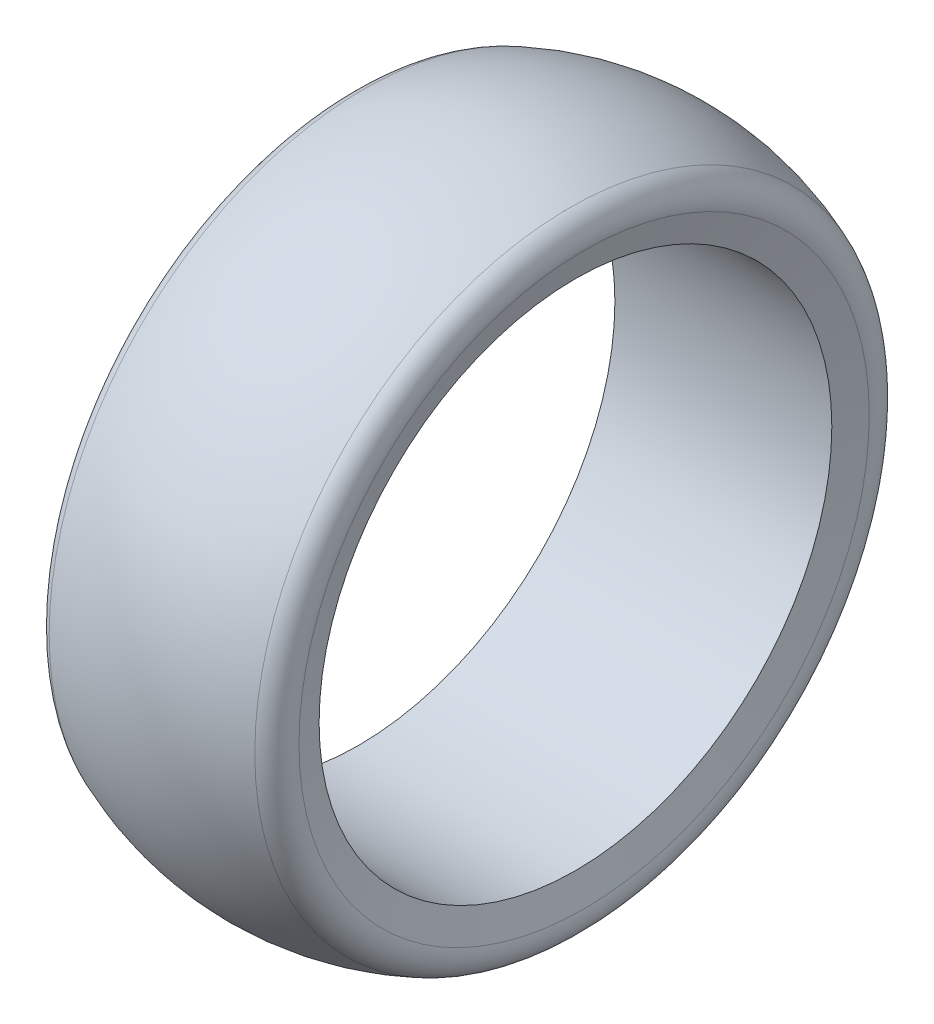
ISO-10303-21;
HEADER;
FILE_DESCRIPTION(('STEP AP214'),'2;1');
FILE_NAME('part.step','',(''),(''),'','','');
FILE_SCHEMA(('AUTOMOTIVE_DESIGN { 1 0 10303 214 1 1 1 1 }'));
ENDSEC;
DATA;
#1=APPLICATION_CONTEXT('core data for automotive mechanical design processes');
#2=APPLICATION_PROTOCOL_DEFINITION('international standard','automotive_design',2000,#1);
#3=PRODUCT_CONTEXT('',#1,'mechanical');
#4=PRODUCT('Part','Part','',(#3));
#5=PRODUCT_RELATED_PRODUCT_CATEGORY('part','',(#4));
#6=PRODUCT_DEFINITION_FORMATION('','',#4);
#7=PRODUCT_DEFINITION_CONTEXT('part definition',#1,'design');
#8=PRODUCT_DEFINITION('design','',#6,#7);
#9=PRODUCT_DEFINITION_SHAPE('','',#8);
#10=(LENGTH_UNIT() NAMED_UNIT(*) SI_UNIT(.MILLI.,.METRE.));
#11=(NAMED_UNIT(*) PLANE_ANGLE_UNIT() SI_UNIT($,.RADIAN.));
#12=(NAMED_UNIT(*) SI_UNIT($,.STERADIAN.) SOLID_ANGLE_UNIT());
#13=UNCERTAINTY_MEASURE_WITH_UNIT(LENGTH_MEASURE(1.E-05),#10,'distance_accuracy_value','');
#14=(GEOMETRIC_REPRESENTATION_CONTEXT(3) GLOBAL_UNCERTAINTY_ASSIGNED_CONTEXT((#13)) GLOBAL_UNIT_ASSIGNED_CONTEXT((#10,
#11,#12)) REPRESENTATION_CONTEXT('',''));
#15=CARTESIAN_POINT('',(0.,0.,0.));
#16=DIRECTION('',(0.,0.,1.));
#17=DIRECTION('',(1.,0.,0.));
#18=AXIS2_PLACEMENT_3D('',#15,#16,#17);
#19=CARTESIAN_POINT('',(12.5,0.,0.));
#20=DIRECTION('',(-1.,0.,0.));
#21=DIRECTION('',(0.,0.,1.));
#22=AXIS2_PLACEMENT_3D('',#19,#20,#21);
#23=DEGENERATE_TOROIDAL_SURFACE('',#22,6.45833333333332,27.5416666666667,.T.);
#24=CARTESIAN_POINT('',(2.07280256558235,0.,0.));
#25=DIRECTION('',(1.,0.,0.));
#26=DIRECTION('',(0.,0.,-1.));
#27=AXIS2_PLACEMENT_3D('',#24,#25,#26);
#28=CIRCLE('',#27,31.9498408690098);
#29=CARTESIAN_POINT('',(2.07280256558235,0.,-31.9498408690098));
#30=VERTEX_POINT('',#29);
#31=EDGE_CURVE('E40',#30,#30,#28,.T.);
#32=ORIENTED_EDGE('',*,*,#31,.T.);
#33=EDGE_LOOP('',(#32));
#34=FACE_BOUND('',#33,.T.);
#35=CARTESIAN_POINT('',(22.9271974344176,0.,0.));
#36=DIRECTION('',(-1.,0.,0.));
#37=DIRECTION('',(0.,0.,1.));
#38=AXIS2_PLACEMENT_3D('',#35,#36,#37);
#39=CIRCLE('',#38,31.9498408690098);
#40=CARTESIAN_POINT('',(22.9271974344176,0.,31.9498408690098));
#41=VERTEX_POINT('',#40);
#42=EDGE_CURVE('E44',#41,#41,#39,.T.);
#43=ORIENTED_EDGE('',*,*,#42,.T.);
#44=EDGE_LOOP('',(#43));
#45=FACE_BOUND('',#44,.T.);
#46=ADVANCED_FACE('F33',(#34,#45),#23,.T.);
#47=CARTESIAN_POINT('',(23.5,0.,0.));
#48=DIRECTION('',(1.,0.,0.));
#49=DIRECTION('',(0.,0.,-1.));
#50=AXIS2_PLACEMENT_3D('',#47,#48,#49);
#51=CONICAL_SURFACE('',#50,26.,1.27933953231703);
#52=CARTESIAN_POINT('',(24.3752701882193,0.,0.));
#53=DIRECTION('',(-1.,0.,0.));
#54=DIRECTION('',(0.,0.,1.));
#55=AXIS2_PLACEMENT_3D('',#52,#53,#54);
#56=CIRCLE('',#55,28.9175672940643);
#57=CARTESIAN_POINT('',(24.3752701882193,0.,28.9175672940643));
#58=VERTEX_POINT('',#57);
#59=EDGE_CURVE('E10',#58,#58,#56,.F.);
#60=ORIENTED_EDGE('',*,*,#59,.T.);
#61=EDGE_LOOP('',(#60));
#62=FACE_BOUND('',#61,.T.);
#63=CARTESIAN_POINT('',(23.5,0.,0.));
#64=DIRECTION('',(-1.,0.,0.));
#65=DIRECTION('',(0.,0.,1.));
#66=AXIS2_PLACEMENT_3D('',#63,#64,#65);
#67=CIRCLE('',#66,26.);
#68=CARTESIAN_POINT('',(23.5,0.,26.));
#69=VERTEX_POINT('',#68);
#70=EDGE_CURVE('E53',#69,#69,#67,.T.);
#71=ORIENTED_EDGE('',*,*,#70,.T.);
#72=EDGE_LOOP('',(#71));
#73=FACE_BOUND('',#72,.T.);
#74=ADVANCED_FACE('F72',(#62,#73),#51,.F.);
#75=CARTESIAN_POINT('',(0.,0.,0.));
#76=DIRECTION('',(-1.,0.,0.));
#77=DIRECTION('',(0.,0.,1.));
#78=AXIS2_PLACEMENT_3D('',#75,#76,#77);
#79=CYLINDRICAL_SURFACE('',#78,26.);
#80=ORIENTED_EDGE('',*,*,#70,.F.);
#81=EDGE_LOOP('',(#80));
#82=FACE_BOUND('',#81,.T.);
#83=CARTESIAN_POINT('',(1.5,0.,0.));
#84=DIRECTION('',(-1.,0.,0.));
#85=DIRECTION('',(0.,0.,1.));
#86=AXIS2_PLACEMENT_3D('',#83,#84,#85);
#87=CIRCLE('',#86,26.);
#88=CARTESIAN_POINT('',(1.5,0.,26.));
#89=VERTEX_POINT('',#88);
#90=EDGE_CURVE('E56',#89,#89,#87,.T.);
#91=ORIENTED_EDGE('',*,*,#90,.T.);
#92=EDGE_LOOP('',(#91));
#93=FACE_BOUND('',#92,.T.);
#94=ADVANCED_FACE('F60',(#82,#93),#79,.F.);
#95=CARTESIAN_POINT('',(0.,0.,0.));
#96=DIRECTION('',(-1.,0.,0.));
#97=DIRECTION('',(0.,0.,1.));
#98=AXIS2_PLACEMENT_3D('',#95,#96,#97);
#99=CONICAL_SURFACE('',#98,31.,1.27933953231703);
#100=CARTESIAN_POINT('',(0.624729811780697,0.,0.));
#101=DIRECTION('',(1.,0.,0.));
#102=DIRECTION('',(0.,0.,-1.));
#103=AXIS2_PLACEMENT_3D('',#100,#101,#102);
#104=CIRCLE('',#103,28.9175672940643);
#105=CARTESIAN_POINT('',(0.624729811780697,0.,-28.9175672940643));
#106=VERTEX_POINT('',#105);
#107=EDGE_CURVE('E48',#106,#106,#104,.F.);
#108=ORIENTED_EDGE('',*,*,#107,.T.);
#109=EDGE_LOOP('',(#108));
#110=FACE_BOUND('',#109,.T.);
#111=ORIENTED_EDGE('',*,*,#90,.F.);
#112=EDGE_LOOP('',(#111));
#113=FACE_BOUND('',#112,.T.);
#114=ADVANCED_FACE('F62',(#110,#113),#99,.F.);
#115=CARTESIAN_POINT('',(3.01929552483358,0.,0.));
#116=DIRECTION('',(1.,0.,0.));
#117=DIRECTION('',(0.,0.,-1.));
#118=AXIS2_PLACEMENT_3D('',#115,#116,#117);
#119=TOROIDAL_SURFACE('',#118,29.6359370079802,2.5);
#120=ORIENTED_EDGE('',*,*,#31,.F.);
#121=EDGE_LOOP('',(#120));
#122=FACE_BOUND('',#121,.T.);
#123=ORIENTED_EDGE('',*,*,#107,.F.);
#124=EDGE_LOOP('',(#123));
#125=FACE_BOUND('',#124,.T.);
#126=ADVANCED_FACE('F64',(#122,#125),#119,.T.);
#127=CARTESIAN_POINT('',(21.9807044751664,0.,0.));
#128=DIRECTION('',(1.,0.,0.));
#129=DIRECTION('',(0.,0.,-1.));
#130=AXIS2_PLACEMENT_3D('',#127,#128,#129);
#131=TOROIDAL_SURFACE('',#130,29.6359370079802,2.5);
#132=ORIENTED_EDGE('',*,*,#59,.F.);
#133=EDGE_LOOP('',(#132));
#134=FACE_BOUND('',#133,.T.);
#135=ORIENTED_EDGE('',*,*,#42,.F.);
#136=EDGE_LOOP('',(#135));
#137=FACE_BOUND('',#136,.T.);
#138=ADVANCED_FACE('F35',(#134,#137),#131,.T.);
#139=CLOSED_SHELL('',(#46,#74,#94,#114,#126,#138));
#140=MANIFOLD_SOLID_BREP('B2',#139);
#141=ADVANCED_BREP_SHAPE_REPRESENTATION('',(#18,#140),#14);
#142=SHAPE_DEFINITION_REPRESENTATION(#9,#141);
ENDSEC;
END-ISO-10303-21;
